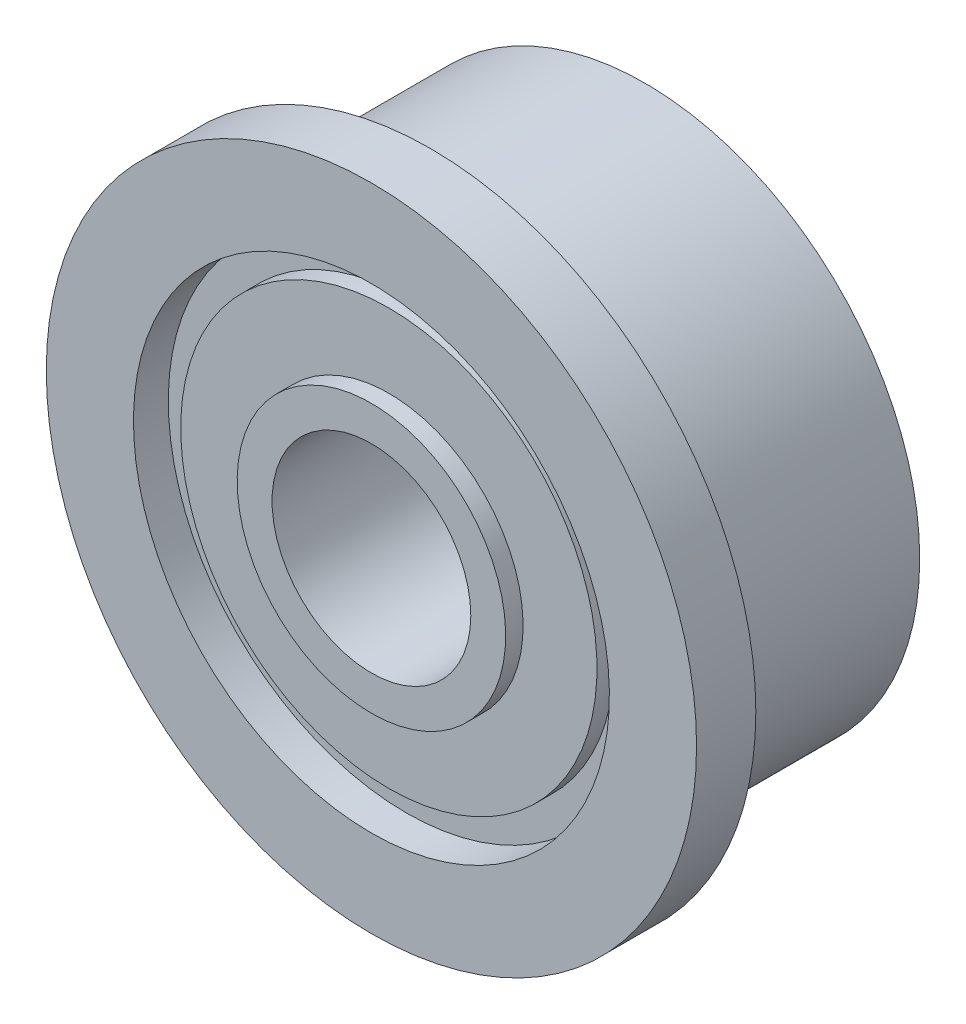
ISO-10303-21;
HEADER;
FILE_DESCRIPTION(('STEP AP214'),'2;1');
FILE_NAME('part.step','',(''),(''),'','','');
FILE_SCHEMA(('AUTOMOTIVE_DESIGN { 1 0 10303 214 1 1 1 1 }'));
ENDSEC;
DATA;
#1=APPLICATION_CONTEXT('core data for automotive mechanical design processes');
#2=APPLICATION_PROTOCOL_DEFINITION('international standard','automotive_design',2000,#1);
#3=PRODUCT_CONTEXT('',#1,'mechanical');
#4=PRODUCT('Part','Part','',(#3));
#5=PRODUCT_RELATED_PRODUCT_CATEGORY('part','',(#4));
#6=PRODUCT_DEFINITION_FORMATION('','',#4);
#7=PRODUCT_DEFINITION_CONTEXT('part definition',#1,'design');
#8=PRODUCT_DEFINITION('design','',#6,#7);
#9=PRODUCT_DEFINITION_SHAPE('','',#8);
#10=(LENGTH_UNIT() NAMED_UNIT(*) SI_UNIT(.MILLI.,.METRE.));
#11=(NAMED_UNIT(*) PLANE_ANGLE_UNIT() SI_UNIT($,.RADIAN.));
#12=(NAMED_UNIT(*) SI_UNIT($,.STERADIAN.) SOLID_ANGLE_UNIT());
#13=UNCERTAINTY_MEASURE_WITH_UNIT(LENGTH_MEASURE(1.E-05),#10,'distance_accuracy_value','');
#14=(GEOMETRIC_REPRESENTATION_CONTEXT(3) GLOBAL_UNCERTAINTY_ASSIGNED_CONTEXT((#13)) GLOBAL_UNIT_ASSIGNED_CONTEXT((#10,
#11,#12)) REPRESENTATION_CONTEXT('',''));
#15=CARTESIAN_POINT('',(0.,0.,0.));
#16=DIRECTION('',(0.,0.,1.));
#17=DIRECTION('',(1.,0.,0.));
#18=AXIS2_PLACEMENT_3D('',#15,#16,#17);
#19=CARTESIAN_POINT('',(0.,4.0005,-3.9878));
#20=DIRECTION('',(0.,0.,1.));
#21=DIRECTION('',(1.,0.,0.));
#22=AXIS2_PLACEMENT_3D('',#19,#20,#21);
#23=PLANE('',#22);
#24=CARTESIAN_POINT('',(0.,0.,-3.9878));
#25=DIRECTION('',(0.,0.,1.));
#26=DIRECTION('',(0.,-1.,0.));
#27=AXIS2_PLACEMENT_3D('',#24,#25,#26);
#28=CIRCLE('',#27,1.9558);
#29=CARTESIAN_POINT('',(0.,-1.9558,-3.9878));
#30=VERTEX_POINT('',#29);
#31=EDGE_CURVE('E95',#30,#30,#28,.T.);
#32=ORIENTED_EDGE('',*,*,#31,.F.);
#33=EDGE_LOOP('',(#32));
#34=FACE_BOUND('',#33,.T.);
#35=CARTESIAN_POINT('',(0.,0.,-3.9878));
#36=DIRECTION('',(0.,0.,1.));
#37=DIRECTION('',(1.,0.,0.));
#38=AXIS2_PLACEMENT_3D('',#35,#36,#37);
#39=CIRCLE('',#38,1.4478);
#40=CARTESIAN_POINT('',(1.4478,0.,-3.9878));
#41=VERTEX_POINT('',#40);
#42=EDGE_CURVE('E62',#41,#41,#39,.T.);
#43=ORIENTED_EDGE('',*,*,#42,.T.);
#44=EDGE_LOOP('',(#43));
#45=FACE_BOUND('',#44,.T.);
#46=ADVANCED_FACE('F36',(#34,#45),#23,.F.);
#47=CARTESIAN_POINT('',(0.,4.7371,0.));
#48=DIRECTION('',(0.,0.,-1.));
#49=DIRECTION('',(-1.,0.,0.));
#50=AXIS2_PLACEMENT_3D('',#47,#48,#49);
#51=PLANE('',#50);
#52=CARTESIAN_POINT('',(0.,0.,0.));
#53=DIRECTION('',(0.,0.,1.));
#54=DIRECTION('',(1.,0.,0.));
#55=AXIS2_PLACEMENT_3D('',#52,#53,#54);
#56=CIRCLE('',#55,1.4478);
#57=CARTESIAN_POINT('',(1.4478,0.,0.));
#58=VERTEX_POINT('',#57);
#59=EDGE_CURVE('E63',#58,#58,#56,.T.);
#60=ORIENTED_EDGE('',*,*,#59,.F.);
#61=EDGE_LOOP('',(#60));
#62=FACE_BOUND('',#61,.T.);
#63=CARTESIAN_POINT('',(0.,0.,0.));
#64=DIRECTION('',(0.,0.,1.));
#65=DIRECTION('',(0.,-1.,0.));
#66=AXIS2_PLACEMENT_3D('',#63,#64,#65);
#67=CIRCLE('',#66,1.9558);
#68=CARTESIAN_POINT('',(0.,-1.9558,0.));
#69=VERTEX_POINT('',#68);
#70=EDGE_CURVE('E83',#69,#69,#67,.T.);
#71=ORIENTED_EDGE('',*,*,#70,.T.);
#72=EDGE_LOOP('',(#71));
#73=FACE_BOUND('',#72,.T.);
#74=ADVANCED_FACE('F103',(#62,#73),#51,.F.);
#75=CARTESIAN_POINT('',(0.,0.,0.));
#76=DIRECTION('',(0.,0.,1.));
#77=DIRECTION('',(1.,0.,0.));
#78=AXIS2_PLACEMENT_3D('',#75,#76,#77);
#79=CIRCLE('',#78,4.7371);
#80=CARTESIAN_POINT('',(4.7371,0.,0.));
#81=VERTEX_POINT('',#80);
#82=EDGE_CURVE('E10',#81,#81,#79,.T.);
#83=ORIENTED_EDGE('',*,*,#82,.T.);
#84=EDGE_LOOP('',(#83));
#85=FACE_BOUND('',#84,.T.);
#86=CARTESIAN_POINT('',(0.,0.,0.));
#87=DIRECTION('',(0.,0.,1.));
#88=DIRECTION('',(0.,-1.,0.));
#89=AXIS2_PLACEMENT_3D('',#86,#87,#88);
#90=CIRCLE('',#89,3.4671);
#91=CARTESIAN_POINT('',(0.,-3.4671,0.));
#92=VERTEX_POINT('',#91);
#93=EDGE_CURVE('E80',#92,#92,#90,.T.);
#94=ORIENTED_EDGE('',*,*,#93,.F.);
#95=EDGE_LOOP('',(#94));
#96=FACE_BOUND('',#95,.T.);
#97=ADVANCED_FACE('F118',(#85,#96),#51,.F.);
#98=CARTESIAN_POINT('',(0.,0.,0.));
#99=DIRECTION('',(0.,0.,1.));
#100=DIRECTION('',(1.,0.,0.));
#101=AXIS2_PLACEMENT_3D('',#98,#99,#100);
#102=CYLINDRICAL_SURFACE('',#101,4.7371);
#103=ORIENTED_EDGE('',*,*,#82,.F.);
#104=EDGE_LOOP('',(#103));
#105=FACE_BOUND('',#104,.T.);
#106=CARTESIAN_POINT('',(0.,0.,-0.863600000000001));
#107=DIRECTION('',(0.,0.,1.));
#108=DIRECTION('',(1.,0.,0.));
#109=AXIS2_PLACEMENT_3D('',#106,#107,#108);
#110=CIRCLE('',#109,4.7371);
#111=CARTESIAN_POINT('',(4.7371,0.,-0.863600000000001));
#112=VERTEX_POINT('',#111);
#113=EDGE_CURVE('E59',#112,#112,#110,.T.);
#114=ORIENTED_EDGE('',*,*,#113,.T.);
#115=EDGE_LOOP('',(#114));
#116=FACE_BOUND('',#115,.T.);
#117=ADVANCED_FACE('F38',(#105,#116),#102,.T.);
#118=CARTESIAN_POINT('',(0.,0.,-3.9878));
#119=DIRECTION('',(0.,0.,1.));
#120=DIRECTION('',(0.,-1.,0.));
#121=AXIS2_PLACEMENT_3D('',#118,#119,#120);
#122=CIRCLE('',#121,3.4925);
#123=CARTESIAN_POINT('',(0.,-3.4925,-3.9878));
#124=VERTEX_POINT('',#123);
#125=EDGE_CURVE('E86',#124,#124,#122,.T.);
#126=ORIENTED_EDGE('',*,*,#125,.T.);
#127=EDGE_LOOP('',(#126));
#128=FACE_BOUND('',#127,.T.);
#129=CARTESIAN_POINT('',(0.,0.,-3.9878));
#130=DIRECTION('',(0.,0.,1.));
#131=DIRECTION('',(1.,0.,0.));
#132=AXIS2_PLACEMENT_3D('',#129,#130,#131);
#133=CIRCLE('',#132,4.0005);
#134=CARTESIAN_POINT('',(4.0005,0.,-3.9878));
#135=VERTEX_POINT('',#134);
#136=EDGE_CURVE('E43',#135,#135,#133,.T.);
#137=ORIENTED_EDGE('',*,*,#136,.F.);
#138=EDGE_LOOP('',(#137));
#139=FACE_BOUND('',#138,.T.);
#140=ADVANCED_FACE('F105',(#128,#139),#23,.F.);
#141=CARTESIAN_POINT('',(0.,0.,0.));
#142=DIRECTION('',(0.,0.,1.));
#143=DIRECTION('',(1.,0.,0.));
#144=AXIS2_PLACEMENT_3D('',#141,#142,#143);
#145=CYLINDRICAL_SURFACE('',#144,4.0005);
#146=CARTESIAN_POINT('',(0.,0.,-1.3716));
#147=DIRECTION('',(0.,0.,1.));
#148=DIRECTION('',(1.,0.,0.));
#149=AXIS2_PLACEMENT_3D('',#146,#147,#148);
#150=CIRCLE('',#149,4.0005);
#151=CARTESIAN_POINT('',(4.0005,0.,-1.3716));
#152=VERTEX_POINT('',#151);
#153=EDGE_CURVE('E47',#152,#152,#150,.T.);
#154=ORIENTED_EDGE('',*,*,#153,.F.);
#155=EDGE_LOOP('',(#154));
#156=FACE_BOUND('',#155,.T.);
#157=ORIENTED_EDGE('',*,*,#136,.T.);
#158=EDGE_LOOP('',(#157));
#159=FACE_BOUND('',#158,.T.);
#160=ADVANCED_FACE('F143',(#156,#159),#145,.T.);
#161=CARTESIAN_POINT('',(0.,4.0005,-1.3716));
#162=DIRECTION('',(0.,0.,-1.));
#163=DIRECTION('',(-1.,0.,0.));
#164=AXIS2_PLACEMENT_3D('',#161,#162,#163);
#165=PLANE('',#164);
#166=CARTESIAN_POINT('',(0.,0.,-1.3716));
#167=DIRECTION('',(0.,0.,1.));
#168=DIRECTION('',(1.,0.,0.));
#169=AXIS2_PLACEMENT_3D('',#166,#167,#168);
#170=CIRCLE('',#169,3.7465);
#171=CARTESIAN_POINT('',(3.7465,0.,-1.3716));
#172=VERTEX_POINT('',#171);
#173=EDGE_CURVE('E51',#172,#172,#170,.T.);
#174=ORIENTED_EDGE('',*,*,#173,.F.);
#175=EDGE_LOOP('',(#174));
#176=FACE_BOUND('',#175,.T.);
#177=ORIENTED_EDGE('',*,*,#153,.T.);
#178=EDGE_LOOP('',(#177));
#179=FACE_BOUND('',#178,.T.);
#180=ADVANCED_FACE('F139',(#176,#179),#165,.F.);
#181=CARTESIAN_POINT('',(0.,0.,0.));
#182=DIRECTION('',(0.,0.,1.));
#183=DIRECTION('',(1.,0.,0.));
#184=AXIS2_PLACEMENT_3D('',#181,#182,#183);
#185=CYLINDRICAL_SURFACE('',#184,3.7465);
#186=CARTESIAN_POINT('',(0.,0.,-0.8636));
#187=DIRECTION('',(0.,0.,1.));
#188=DIRECTION('',(1.,0.,0.));
#189=AXIS2_PLACEMENT_3D('',#186,#187,#188);
#190=CIRCLE('',#189,3.7465);
#191=CARTESIAN_POINT('',(3.7465,0.,-0.8636));
#192=VERTEX_POINT('',#191);
#193=EDGE_CURVE('E56',#192,#192,#190,.T.);
#194=ORIENTED_EDGE('',*,*,#193,.F.);
#195=EDGE_LOOP('',(#194));
#196=FACE_BOUND('',#195,.T.);
#197=ORIENTED_EDGE('',*,*,#173,.T.);
#198=EDGE_LOOP('',(#197));
#199=FACE_BOUND('',#198,.T.);
#200=ADVANCED_FACE('F135',(#196,#199),#185,.T.);
#201=CARTESIAN_POINT('',(0.,3.7465,-0.863600000000001));
#202=DIRECTION('',(0.,0.,1.));
#203=DIRECTION('',(1.,0.,0.));
#204=AXIS2_PLACEMENT_3D('',#201,#202,#203);
#205=PLANE('',#204);
#206=ORIENTED_EDGE('',*,*,#113,.F.);
#207=EDGE_LOOP('',(#206));
#208=FACE_BOUND('',#207,.T.);
#209=ORIENTED_EDGE('',*,*,#193,.T.);
#210=EDGE_LOOP('',(#209));
#211=FACE_BOUND('',#210,.T.);
#212=ADVANCED_FACE('F112',(#208,#211),#205,.F.);
#213=CARTESIAN_POINT('',(0.,0.,-3.9878));
#214=DIRECTION('',(0.,0.,1.));
#215=DIRECTION('',(1.,0.,0.));
#216=AXIS2_PLACEMENT_3D('',#213,#214,#215);
#217=CYLINDRICAL_SURFACE('',#216,1.4478);
#218=ORIENTED_EDGE('',*,*,#42,.F.);
#219=EDGE_LOOP('',(#218));
#220=FACE_BOUND('',#219,.T.);
#221=ORIENTED_EDGE('',*,*,#59,.T.);
#222=EDGE_LOOP('',(#221));
#223=FACE_BOUND('',#222,.T.);
#224=ADVANCED_FACE('F108',(#220,#223),#217,.F.);
#225=CARTESIAN_POINT('',(0.,0.,0.));
#226=DIRECTION('',(0.,0.,1.));
#227=DIRECTION('',(0.,-1.,0.));
#228=AXIS2_PLACEMENT_3D('',#225,#226,#227);
#229=CYLINDRICAL_SURFACE('',#228,1.9558);
#230=CARTESIAN_POINT('',(0.,0.,-0.254));
#231=DIRECTION('',(0.,0.,1.));
#232=DIRECTION('',(0.,-1.,0.));
#233=AXIS2_PLACEMENT_3D('',#230,#231,#232);
#234=CIRCLE('',#233,1.9558);
#235=CARTESIAN_POINT('',(0.,-1.9558,-0.253999999999999));
#236=VERTEX_POINT('',#235);
#237=EDGE_CURVE('E66',#236,#236,#234,.T.);
#238=ORIENTED_EDGE('',*,*,#237,.T.);
#239=EDGE_LOOP('',(#238));
#240=FACE_BOUND('',#239,.T.);
#241=ORIENTED_EDGE('',*,*,#70,.F.);
#242=EDGE_LOOP('',(#241));
#243=FACE_BOUND('',#242,.T.);
#244=ADVANCED_FACE('F111',(#240,#243),#229,.T.);
#245=CARTESIAN_POINT('',(0.,1.9558,-0.254));
#246=DIRECTION('',(0.,0.,1.));
#247=DIRECTION('',(0.,-1.,0.));
#248=AXIS2_PLACEMENT_3D('',#245,#246,#247);
#249=PLANE('',#248);
#250=CARTESIAN_POINT('',(0.,0.,-0.254));
#251=DIRECTION('',(0.,0.,1.));
#252=DIRECTION('',(0.,-1.,0.));
#253=AXIS2_PLACEMENT_3D('',#250,#251,#252);
#254=CIRCLE('',#253,3.03227531632783);
#255=CARTESIAN_POINT('',(0.,-3.03227531632783,-0.253999999999999));
#256=VERTEX_POINT('',#255);
#257=EDGE_CURVE('E71',#256,#256,#254,.T.);
#258=ORIENTED_EDGE('',*,*,#257,.T.);
#259=EDGE_LOOP('',(#258));
#260=FACE_BOUND('',#259,.T.);
#261=ORIENTED_EDGE('',*,*,#237,.F.);
#262=EDGE_LOOP('',(#261));
#263=FACE_BOUND('',#262,.T.);
#264=ADVANCED_FACE('F122',(#260,#263),#249,.T.);
#265=CARTESIAN_POINT('',(0.,0.,0.));
#266=DIRECTION('',(0.,0.,1.));
#267=DIRECTION('',(0.,-1.,0.));
#268=AXIS2_PLACEMENT_3D('',#265,#266,#267);
#269=CYLINDRICAL_SURFACE('',#268,3.03227531632783);
#270=CARTESIAN_POINT('',(0.,0.,-0.507999999999999));
#271=DIRECTION('',(0.,0.,1.));
#272=DIRECTION('',(0.,-1.,0.));
#273=AXIS2_PLACEMENT_3D('',#270,#271,#272);
#274=CIRCLE('',#273,3.03227531632783);
#275=CARTESIAN_POINT('',(0.,-3.03227531632783,-0.507999999999999));
#276=VERTEX_POINT('',#275);
#277=EDGE_CURVE('E74',#276,#276,#274,.T.);
#278=ORIENTED_EDGE('',*,*,#277,.T.);
#279=EDGE_LOOP('',(#278));
#280=FACE_BOUND('',#279,.T.);
#281=ORIENTED_EDGE('',*,*,#257,.F.);
#282=EDGE_LOOP('',(#281));
#283=FACE_BOUND('',#282,.T.);
#284=ADVANCED_FACE('F128',(#280,#283),#269,.T.);
#285=CARTESIAN_POINT('',(0.,3.03227531632783,-0.508));
#286=DIRECTION('',(0.,0.,1.));
#287=DIRECTION('',(0.,-1.,0.));
#288=AXIS2_PLACEMENT_3D('',#285,#286,#287);
#289=PLANE('',#288);
#290=CARTESIAN_POINT('',(0.,0.,-0.507999999999999));
#291=DIRECTION('',(0.,0.,1.));
#292=DIRECTION('',(0.,-1.,0.));
#293=AXIS2_PLACEMENT_3D('',#290,#291,#292);
#294=CIRCLE('',#293,3.4671);
#295=CARTESIAN_POINT('',(0.,-3.4671,-0.507999999999999));
#296=VERTEX_POINT('',#295);
#297=EDGE_CURVE('E77',#296,#296,#294,.T.);
#298=ORIENTED_EDGE('',*,*,#297,.T.);
#299=EDGE_LOOP('',(#298));
#300=FACE_BOUND('',#299,.T.);
#301=ORIENTED_EDGE('',*,*,#277,.F.);
#302=EDGE_LOOP('',(#301));
#303=FACE_BOUND('',#302,.T.);
#304=ADVANCED_FACE('F174',(#300,#303),#289,.T.);
#305=CARTESIAN_POINT('',(0.,0.,0.));
#306=DIRECTION('',(0.,0.,1.));
#307=DIRECTION('',(0.,-1.,0.));
#308=AXIS2_PLACEMENT_3D('',#305,#306,#307);
#309=CYLINDRICAL_SURFACE('',#308,3.4671);
#310=ORIENTED_EDGE('',*,*,#93,.T.);
#311=EDGE_LOOP('',(#310));
#312=FACE_BOUND('',#311,.T.);
#313=ORIENTED_EDGE('',*,*,#297,.F.);
#314=EDGE_LOOP('',(#313));
#315=FACE_BOUND('',#314,.T.);
#316=ADVANCED_FACE('F169',(#312,#315),#309,.F.);
#317=CARTESIAN_POINT('',(0.,0.,0.));
#318=DIRECTION('',(0.,0.,1.));
#319=DIRECTION('',(0.,-1.,0.));
#320=AXIS2_PLACEMENT_3D('',#317,#318,#319);
#321=CYLINDRICAL_SURFACE('',#320,1.9558);
#322=CARTESIAN_POINT('',(0.,0.,-3.7338));
#323=DIRECTION('',(0.,0.,1.));
#324=DIRECTION('',(0.,-1.,0.));
#325=AXIS2_PLACEMENT_3D('',#322,#323,#324);
#326=CIRCLE('',#325,1.9558);
#327=CARTESIAN_POINT('',(0.,-1.9558,-3.7338));
#328=VERTEX_POINT('',#327);
#329=EDGE_CURVE('E92',#328,#328,#326,.T.);
#330=ORIENTED_EDGE('',*,*,#329,.F.);
#331=EDGE_LOOP('',(#330));
#332=FACE_BOUND('',#331,.T.);
#333=ORIENTED_EDGE('',*,*,#31,.T.);
#334=EDGE_LOOP('',(#333));
#335=FACE_BOUND('',#334,.T.);
#336=ADVANCED_FACE('F99',(#332,#335),#321,.T.);
#337=CARTESIAN_POINT('',(0.,1.9558,-3.7338));
#338=DIRECTION('',(0.,0.,1.));
#339=DIRECTION('',(0.,-1.,0.));
#340=AXIS2_PLACEMENT_3D('',#337,#338,#339);
#341=PLANE('',#340);
#342=CARTESIAN_POINT('',(0.,0.,-3.7338));
#343=DIRECTION('',(0.,0.,1.));
#344=DIRECTION('',(0.,-1.,0.));
#345=AXIS2_PLACEMENT_3D('',#342,#343,#344);
#346=CIRCLE('',#345,2.9845);
#347=CARTESIAN_POINT('',(0.,-2.9845,-3.7338));
#348=VERTEX_POINT('',#347);
#349=EDGE_CURVE('E89',#348,#348,#346,.T.);
#350=ORIENTED_EDGE('',*,*,#349,.F.);
#351=EDGE_LOOP('',(#350));
#352=FACE_BOUND('',#351,.T.);
#353=ORIENTED_EDGE('',*,*,#329,.T.);
#354=EDGE_LOOP('',(#353));
#355=FACE_BOUND('',#354,.T.);
#356=ADVANCED_FACE('F159',(#352,#355),#341,.F.);
#357=CARTESIAN_POINT('',(0.,0.,-3.7338));
#358=DIRECTION('',(0.,0.,-1.));
#359=DIRECTION('',(0.,1.,0.));
#360=AXIS2_PLACEMENT_3D('',#357,#358,#359);
#361=CONICAL_SURFACE('',#360,2.9845,1.10714871779409);
#362=ORIENTED_EDGE('',*,*,#125,.F.);
#363=EDGE_LOOP('',(#362));
#364=FACE_BOUND('',#363,.T.);
#365=ORIENTED_EDGE('',*,*,#349,.T.);
#366=EDGE_LOOP('',(#365));
#367=FACE_BOUND('',#366,.T.);
#368=ADVANCED_FACE('F156',(#364,#367),#361,.F.);
#369=CLOSED_SHELL('',(#46,#74,#97,#117,#140,#160,#180,#200,#212,#224,#244,#264,#284,#304,#316,
#336,#356,#368));
#370=MANIFOLD_SOLID_BREP('B2',#369);
#371=ADVANCED_BREP_SHAPE_REPRESENTATION('',(#18,#370),#14);
#372=SHAPE_DEFINITION_REPRESENTATION(#9,#371);
ENDSEC;
END-ISO-10303-21;
